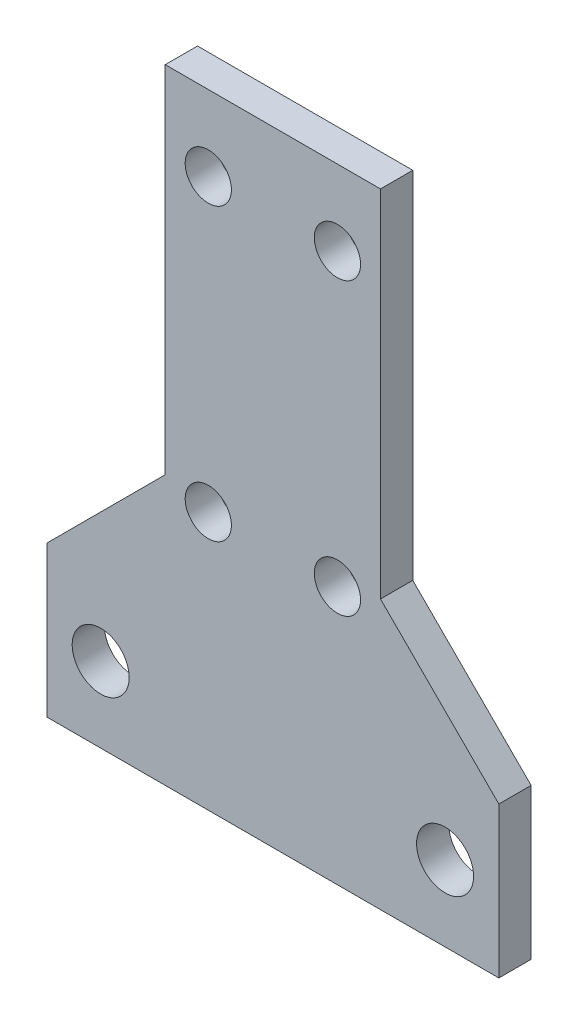
ISO-10303-21;
HEADER;
FILE_DESCRIPTION(('STEP AP214'),'2;1');
FILE_NAME('part.step','',(''),(''),'','','');
FILE_SCHEMA(('AUTOMOTIVE_DESIGN { 1 0 10303 214 1 1 1 1 }'));
ENDSEC;
DATA;
#1=APPLICATION_CONTEXT('core data for automotive mechanical design processes');
#2=APPLICATION_PROTOCOL_DEFINITION('international standard','automotive_design',2000,#1);
#3=PRODUCT_CONTEXT('',#1,'mechanical');
#4=PRODUCT('Part','Part','',(#3));
#5=PRODUCT_RELATED_PRODUCT_CATEGORY('part','',(#4));
#6=PRODUCT_DEFINITION_FORMATION('','',#4);
#7=PRODUCT_DEFINITION_CONTEXT('part definition',#1,'design');
#8=PRODUCT_DEFINITION('design','',#6,#7);
#9=PRODUCT_DEFINITION_SHAPE('','',#8);
#10=(LENGTH_UNIT() NAMED_UNIT(*) SI_UNIT(.MILLI.,.METRE.));
#11=(NAMED_UNIT(*) PLANE_ANGLE_UNIT() SI_UNIT($,.RADIAN.));
#12=(NAMED_UNIT(*) SI_UNIT($,.STERADIAN.) SOLID_ANGLE_UNIT());
#13=UNCERTAINTY_MEASURE_WITH_UNIT(LENGTH_MEASURE(1.E-05),#10,'distance_accuracy_value','');
#14=(GEOMETRIC_REPRESENTATION_CONTEXT(3) GLOBAL_UNCERTAINTY_ASSIGNED_CONTEXT((#13)) GLOBAL_UNIT_ASSIGNED_CONTEXT((#10,
#11,#12)) REPRESENTATION_CONTEXT('',''));
#15=CARTESIAN_POINT('',(0.,0.,0.));
#16=DIRECTION('',(0.,0.,1.));
#17=DIRECTION('',(1.,0.,0.));
#18=AXIS2_PLACEMENT_3D('',#15,#16,#17);
#19=CARTESIAN_POINT('',(0.,0.,3.));
#20=DIRECTION('',(0.,0.,-1.));
#21=DIRECTION('',(-1.,0.,0.));
#22=AXIS2_PLACEMENT_3D('',#19,#20,#21);
#23=PLANE('',#22);
#24=DIRECTION('',(0.,-1.,0.));
#25=VECTOR('',#24,1.);
#26=CARTESIAN_POINT('',(-434.489921235063,165.000000000073,3.));
#27=LINE('',#26,#25);
#28=CARTESIAN_POINT('',(-434.489921235063,179.000000000073,3.));
#29=VERTEX_POINT('',#28);
#30=CARTESIAN_POINT('',(-434.489921235063,165.000000000073,3.));
#31=VERTEX_POINT('',#30);
#32=EDGE_CURVE('E147',#29,#31,#27,.T.);
#33=ORIENTED_EDGE('',*,*,#32,.T.);
#34=DIRECTION('',(1.,0.,0.));
#35=VECTOR('',#34,1.);
#36=CARTESIAN_POINT('',(-434.489921235063,165.000000000073,3.));
#37=LINE('',#36,#35);
#38=CARTESIAN_POINT('',(-392.489921235063,165.000000000073,3.));
#39=VERTEX_POINT('',#38);
#40=EDGE_CURVE('E95',#31,#39,#37,.T.);
#41=ORIENTED_EDGE('',*,*,#40,.T.);
#42=DIRECTION('',(0.,1.,0.));
#43=VECTOR('',#42,1.);
#44=CARTESIAN_POINT('',(-392.489921235063,165.000000000073,3.));
#45=LINE('',#44,#43);
#46=CARTESIAN_POINT('',(-392.489921235063,179.000000000073,3.));
#47=VERTEX_POINT('',#46);
#48=EDGE_CURVE('E162',#39,#47,#45,.T.);
#49=ORIENTED_EDGE('',*,*,#48,.T.);
#50=DIRECTION('',(-0.707106781186552,0.707106781186543,0.));
#51=VECTOR('',#50,1.);
#52=CARTESIAN_POINT('',(-392.489921235063,179.000000000073,3.));
#53=LINE('',#52,#51);
#54=CARTESIAN_POINT('',(-403.489921235063,190.000000000073,3.));
#55=VERTEX_POINT('',#54);
#56=EDGE_CURVE('E175',#47,#55,#53,.T.);
#57=ORIENTED_EDGE('',*,*,#56,.T.);
#58=DIRECTION('',(0.,1.,0.));
#59=VECTOR('',#58,1.);
#60=CARTESIAN_POINT('',(-403.489921235063,190.000000000073,3.));
#61=LINE('',#60,#59);
#62=CARTESIAN_POINT('',(-403.489921235063,223.000000000073,3.));
#63=VERTEX_POINT('',#62);
#64=EDGE_CURVE('E114',#55,#63,#61,.T.);
#65=ORIENTED_EDGE('',*,*,#64,.T.);
#66=DIRECTION('',(-1.,0.,0.));
#67=VECTOR('',#66,1.);
#68=CARTESIAN_POINT('',(-423.489921235064,223.000000000073,3.));
#69=LINE('',#68,#67);
#70=CARTESIAN_POINT('',(-423.489921235064,223.000000000073,3.));
#71=VERTEX_POINT('',#70);
#72=EDGE_CURVE('E108',#63,#71,#69,.T.);
#73=ORIENTED_EDGE('',*,*,#72,.T.);
#74=DIRECTION('',(0.,-1.,0.));
#75=VECTOR('',#74,1.);
#76=CARTESIAN_POINT('',(-423.489921235064,190.000000000073,3.));
#77=LINE('',#76,#75);
#78=CARTESIAN_POINT('',(-423.489921235064,190.000000000073,3.));
#79=VERTEX_POINT('',#78);
#80=EDGE_CURVE('E112',#71,#79,#77,.T.);
#81=ORIENTED_EDGE('',*,*,#80,.T.);
#82=DIRECTION('',(-0.707106781186552,-0.707106781186543,0.));
#83=VECTOR('',#82,1.);
#84=CARTESIAN_POINT('',(-434.489921235063,179.000000000073,3.));
#85=LINE('',#84,#83);
#86=EDGE_CURVE('E52',#79,#29,#85,.T.);
#87=ORIENTED_EDGE('',*,*,#86,.T.);
#88=EDGE_LOOP('',(#33,#41,#49,#57,#65,#73,#81,#87));
#89=FACE_BOUND('',#88,.T.);
#90=CARTESIAN_POINT('',(-397.489921235063,172.000000000073,3.));
#91=DIRECTION('',(0.,0.,1.));
#92=DIRECTION('',(1.,0.,0.));
#93=AXIS2_PLACEMENT_3D('',#90,#91,#92);
#94=CIRCLE('',#93,2.64999999999998);
#95=CARTESIAN_POINT('',(-394.839921235063,172.000000000073,3.));
#96=VERTEX_POINT('',#95);
#97=EDGE_CURVE('E136',#96,#96,#94,.T.);
#98=ORIENTED_EDGE('',*,*,#97,.F.);
#99=EDGE_LOOP('',(#98));
#100=FACE_BOUND('',#99,.T.);
#101=CARTESIAN_POINT('',(-407.489921235063,216.000000000073,3.));
#102=DIRECTION('',(0.,0.,1.));
#103=DIRECTION('',(1.,0.,0.));
#104=AXIS2_PLACEMENT_3D('',#101,#102,#103);
#105=CIRCLE('',#104,2.14999999999996);
#106=CARTESIAN_POINT('',(-405.339921235063,216.000000000073,3.));
#107=VERTEX_POINT('',#106);
#108=EDGE_CURVE('E184',#107,#107,#105,.T.);
#109=ORIENTED_EDGE('',*,*,#108,.F.);
#110=EDGE_LOOP('',(#109));
#111=FACE_BOUND('',#110,.T.);
#112=CARTESIAN_POINT('',(-407.489921235063,189.000000000073,3.));
#113=DIRECTION('',(0.,0.,1.));
#114=DIRECTION('',(1.,0.,0.));
#115=AXIS2_PLACEMENT_3D('',#112,#113,#114);
#116=CIRCLE('',#115,2.14999999999996);
#117=CARTESIAN_POINT('',(-405.339921235063,189.000000000073,3.));
#118=VERTEX_POINT('',#117);
#119=EDGE_CURVE('E190',#118,#118,#116,.T.);
#120=ORIENTED_EDGE('',*,*,#119,.F.);
#121=EDGE_LOOP('',(#120));
#122=FACE_BOUND('',#121,.T.);
#123=CARTESIAN_POINT('',(-429.489921235063,172.000000000073,3.));
#124=DIRECTION('',(0.,0.,1.));
#125=DIRECTION('',(-1.,0.,0.));
#126=AXIS2_PLACEMENT_3D('',#123,#124,#125);
#127=CIRCLE('',#126,2.64999999999998);
#128=CARTESIAN_POINT('',(-432.139921235063,172.000000000073,3.));
#129=VERTEX_POINT('',#128);
#130=EDGE_CURVE('E196',#129,#129,#127,.T.);
#131=ORIENTED_EDGE('',*,*,#130,.F.);
#132=EDGE_LOOP('',(#131));
#133=FACE_BOUND('',#132,.T.);
#134=CARTESIAN_POINT('',(-419.489921235064,189.000000000073,3.));
#135=DIRECTION('',(0.,0.,1.));
#136=DIRECTION('',(-1.,0.,0.));
#137=AXIS2_PLACEMENT_3D('',#134,#135,#136);
#138=CIRCLE('',#137,2.14999999999996);
#139=CARTESIAN_POINT('',(-421.639921235064,189.000000000073,3.));
#140=VERTEX_POINT('',#139);
#141=EDGE_CURVE('E202',#140,#140,#138,.T.);
#142=ORIENTED_EDGE('',*,*,#141,.F.);
#143=EDGE_LOOP('',(#142));
#144=FACE_BOUND('',#143,.T.);
#145=CARTESIAN_POINT('',(-419.489921235064,216.000000000073,3.));
#146=DIRECTION('',(0.,0.,1.));
#147=DIRECTION('',(-1.,0.,0.));
#148=AXIS2_PLACEMENT_3D('',#145,#146,#147);
#149=CIRCLE('',#148,2.14999999999996);
#150=CARTESIAN_POINT('',(-421.639921235064,216.000000000073,3.));
#151=VERTEX_POINT('',#150);
#152=EDGE_CURVE('E208',#151,#151,#149,.T.);
#153=ORIENTED_EDGE('',*,*,#152,.F.);
#154=EDGE_LOOP('',(#153));
#155=FACE_BOUND('',#154,.T.);
#156=ADVANCED_FACE('F35',(#89,#100,#111,#122,#133,#144,#155),#23,.F.);
#157=CARTESIAN_POINT('',(0.,0.,0.));
#158=DIRECTION('',(0.,0.,-1.));
#159=DIRECTION('',(-1.,0.,0.));
#160=AXIS2_PLACEMENT_3D('',#157,#158,#159);
#161=PLANE('',#160);
#162=CARTESIAN_POINT('',(-419.489921235064,189.000000000073,0.));
#163=DIRECTION('',(0.,0.,1.));
#164=DIRECTION('',(-1.,0.,0.));
#165=AXIS2_PLACEMENT_3D('',#162,#163,#164);
#166=CIRCLE('',#165,2.14999999999996);
#167=CARTESIAN_POINT('',(-421.639921235064,189.000000000073,0.));
#168=VERTEX_POINT('',#167);
#169=EDGE_CURVE('E205',#168,#168,#166,.T.);
#170=ORIENTED_EDGE('',*,*,#169,.T.);
#171=EDGE_LOOP('',(#170));
#172=FACE_BOUND('',#171,.T.);
#173=CARTESIAN_POINT('',(-407.489921235063,189.000000000073,0.));
#174=DIRECTION('',(0.,0.,1.));
#175=DIRECTION('',(1.,0.,0.));
#176=AXIS2_PLACEMENT_3D('',#173,#174,#175);
#177=CIRCLE('',#176,2.14999999999996);
#178=CARTESIAN_POINT('',(-405.339921235063,189.000000000073,0.));
#179=VERTEX_POINT('',#178);
#180=EDGE_CURVE('E193',#179,#179,#177,.T.);
#181=ORIENTED_EDGE('',*,*,#180,.T.);
#182=EDGE_LOOP('',(#181));
#183=FACE_BOUND('',#182,.T.);
#184=CARTESIAN_POINT('',(-397.489921235063,172.000000000073,0.));
#185=DIRECTION('',(0.,0.,1.));
#186=DIRECTION('',(1.,0.,0.));
#187=AXIS2_PLACEMENT_3D('',#184,#185,#186);
#188=CIRCLE('',#187,2.64999999999998);
#189=CARTESIAN_POINT('',(-394.839921235063,172.000000000073,0.));
#190=VERTEX_POINT('',#189);
#191=EDGE_CURVE('E181',#190,#190,#188,.T.);
#192=ORIENTED_EDGE('',*,*,#191,.T.);
#193=EDGE_LOOP('',(#192));
#194=FACE_BOUND('',#193,.T.);
#195=DIRECTION('',(0.,-1.,0.));
#196=VECTOR('',#195,1.);
#197=CARTESIAN_POINT('',(-434.489921235063,165.000000000073,0.));
#198=LINE('',#197,#196);
#199=CARTESIAN_POINT('',(-434.489921235063,179.000000000073,0.));
#200=VERTEX_POINT('',#199);
#201=CARTESIAN_POINT('',(-434.489921235063,165.000000000073,0.));
#202=VERTEX_POINT('',#201);
#203=EDGE_CURVE('E132',#200,#202,#198,.T.);
#204=ORIENTED_EDGE('',*,*,#203,.F.);
#205=DIRECTION('',(-0.707106781186552,-0.707106781186543,0.));
#206=VECTOR('',#205,1.);
#207=CARTESIAN_POINT('',(-434.489921235063,179.000000000073,0.));
#208=LINE('',#207,#206);
#209=CARTESIAN_POINT('',(-423.489921235064,190.000000000073,0.));
#210=VERTEX_POINT('',#209);
#211=EDGE_CURVE('E87',#210,#200,#208,.T.);
#212=ORIENTED_EDGE('',*,*,#211,.F.);
#213=DIRECTION('',(0.,-1.,0.));
#214=VECTOR('',#213,1.);
#215=CARTESIAN_POINT('',(-423.489921235064,190.000000000073,0.));
#216=LINE('',#215,#214);
#217=CARTESIAN_POINT('',(-423.489921235064,223.000000000073,0.));
#218=VERTEX_POINT('',#217);
#219=EDGE_CURVE('E81',#218,#210,#216,.T.);
#220=ORIENTED_EDGE('',*,*,#219,.F.);
#221=DIRECTION('',(-1.,0.,0.));
#222=VECTOR('',#221,1.);
#223=CARTESIAN_POINT('',(-423.489921235064,223.000000000073,0.));
#224=LINE('',#223,#222);
#225=CARTESIAN_POINT('',(-403.489921235063,223.000000000073,0.));
#226=VERTEX_POINT('',#225);
#227=EDGE_CURVE('E122',#226,#218,#224,.T.);
#228=ORIENTED_EDGE('',*,*,#227,.F.);
#229=DIRECTION('',(0.,1.,0.));
#230=VECTOR('',#229,1.);
#231=CARTESIAN_POINT('',(-403.489921235063,190.000000000073,0.));
#232=LINE('',#231,#230);
#233=CARTESIAN_POINT('',(-403.489921235063,190.000000000073,0.));
#234=VERTEX_POINT('',#233);
#235=EDGE_CURVE('E142',#234,#226,#232,.T.);
#236=ORIENTED_EDGE('',*,*,#235,.F.);
#237=DIRECTION('',(-0.707106781186552,0.707106781186543,0.));
#238=VECTOR('',#237,1.);
#239=CARTESIAN_POINT('',(-392.489921235063,179.000000000073,0.));
#240=LINE('',#239,#238);
#241=CARTESIAN_POINT('',(-392.489921235063,179.000000000073,0.));
#242=VERTEX_POINT('',#241);
#243=EDGE_CURVE('E140',#242,#234,#240,.T.);
#244=ORIENTED_EDGE('',*,*,#243,.F.);
#245=DIRECTION('',(0.,1.,0.));
#246=VECTOR('',#245,1.);
#247=CARTESIAN_POINT('',(-392.489921235063,165.000000000073,0.));
#248=LINE('',#247,#246);
#249=CARTESIAN_POINT('',(-392.489921235063,165.000000000073,0.));
#250=VERTEX_POINT('',#249);
#251=EDGE_CURVE('E138',#250,#242,#248,.T.);
#252=ORIENTED_EDGE('',*,*,#251,.F.);
#253=DIRECTION('',(1.,0.,0.));
#254=VECTOR('',#253,1.);
#255=CARTESIAN_POINT('',(-434.489921235063,165.000000000073,0.));
#256=LINE('',#255,#254);
#257=EDGE_CURVE('E135',#202,#250,#256,.T.);
#258=ORIENTED_EDGE('',*,*,#257,.F.);
#259=EDGE_LOOP('',(#204,#212,#220,#228,#236,#244,#252,#258));
#260=FACE_BOUND('',#259,.T.);
#261=CARTESIAN_POINT('',(-407.489921235063,216.000000000073,0.));
#262=DIRECTION('',(0.,0.,1.));
#263=DIRECTION('',(1.,0.,0.));
#264=AXIS2_PLACEMENT_3D('',#261,#262,#263);
#265=CIRCLE('',#264,2.14999999999996);
#266=CARTESIAN_POINT('',(-405.339921235063,216.000000000073,0.));
#267=VERTEX_POINT('',#266);
#268=EDGE_CURVE('E187',#267,#267,#265,.T.);
#269=ORIENTED_EDGE('',*,*,#268,.T.);
#270=EDGE_LOOP('',(#269));
#271=FACE_BOUND('',#270,.T.);
#272=CARTESIAN_POINT('',(-429.489921235063,172.000000000073,0.));
#273=DIRECTION('',(0.,0.,1.));
#274=DIRECTION('',(-1.,0.,0.));
#275=AXIS2_PLACEMENT_3D('',#272,#273,#274);
#276=CIRCLE('',#275,2.64999999999998);
#277=CARTESIAN_POINT('',(-432.139921235063,172.000000000073,0.));
#278=VERTEX_POINT('',#277);
#279=EDGE_CURVE('E199',#278,#278,#276,.T.);
#280=ORIENTED_EDGE('',*,*,#279,.T.);
#281=EDGE_LOOP('',(#280));
#282=FACE_BOUND('',#281,.T.);
#283=CARTESIAN_POINT('',(-419.489921235064,216.000000000073,0.));
#284=DIRECTION('',(0.,0.,1.));
#285=DIRECTION('',(-1.,0.,0.));
#286=AXIS2_PLACEMENT_3D('',#283,#284,#285);
#287=CIRCLE('',#286,2.14999999999996);
#288=CARTESIAN_POINT('',(-421.639921235064,216.000000000073,0.));
#289=VERTEX_POINT('',#288);
#290=EDGE_CURVE('E211',#289,#289,#287,.T.);
#291=ORIENTED_EDGE('',*,*,#290,.T.);
#292=EDGE_LOOP('',(#291));
#293=FACE_BOUND('',#292,.T.);
#294=ADVANCED_FACE('F166',(#172,#183,#194,#260,#271,#282,#293),#161,.T.);
#295=CARTESIAN_POINT('',(-434.489921235063,165.000000000073,3.));
#296=DIRECTION('',(1.,0.,0.));
#297=DIRECTION('',(0.,1.,0.));
#298=AXIS2_PLACEMENT_3D('',#295,#296,#297);
#299=PLANE('',#298);
#300=ORIENTED_EDGE('',*,*,#203,.T.);
#301=DIRECTION('',(0.,0.,-1.));
#302=VECTOR('',#301,1.);
#303=CARTESIAN_POINT('',(-434.489921235063,165.000000000073,3.));
#304=LINE('',#303,#302);
#305=EDGE_CURVE('E11',#31,#202,#304,.T.);
#306=ORIENTED_EDGE('',*,*,#305,.F.);
#307=ORIENTED_EDGE('',*,*,#32,.F.);
#308=DIRECTION('',(0.,0.,-1.));
#309=VECTOR('',#308,1.);
#310=CARTESIAN_POINT('',(-434.489921235063,179.000000000073,3.));
#311=LINE('',#310,#309);
#312=EDGE_CURVE('E128',#29,#200,#311,.T.);
#313=ORIENTED_EDGE('',*,*,#312,.T.);
#314=EDGE_LOOP('',(#300,#306,#307,#313));
#315=FACE_BOUND('',#314,.T.);
#316=ADVANCED_FACE('F37',(#315),#299,.F.);
#317=CARTESIAN_POINT('',(-434.489921235063,165.000000000073,3.));
#318=DIRECTION('',(0.,1.,0.));
#319=DIRECTION('',(0.,0.,1.));
#320=AXIS2_PLACEMENT_3D('',#317,#318,#319);
#321=PLANE('',#320);
#322=ORIENTED_EDGE('',*,*,#257,.T.);
#323=DIRECTION('',(0.,0.,-1.));
#324=VECTOR('',#323,1.);
#325=CARTESIAN_POINT('',(-392.489921235063,165.000000000073,3.));
#326=LINE('',#325,#324);
#327=EDGE_CURVE('E44',#39,#250,#326,.T.);
#328=ORIENTED_EDGE('',*,*,#327,.F.);
#329=ORIENTED_EDGE('',*,*,#40,.F.);
#330=ORIENTED_EDGE('',*,*,#305,.T.);
#331=EDGE_LOOP('',(#322,#328,#329,#330));
#332=FACE_BOUND('',#331,.T.);
#333=ADVANCED_FACE('F243',(#332),#321,.F.);
#334=CARTESIAN_POINT('',(-392.489921235063,165.000000000073,3.));
#335=DIRECTION('',(-1.,0.,0.));
#336=DIRECTION('',(0.,0.,1.));
#337=AXIS2_PLACEMENT_3D('',#334,#335,#336);
#338=PLANE('',#337);
#339=ORIENTED_EDGE('',*,*,#251,.T.);
#340=DIRECTION('',(0.,0.,-1.));
#341=VECTOR('',#340,1.);
#342=CARTESIAN_POINT('',(-392.489921235063,179.000000000073,3.));
#343=LINE('',#342,#341);
#344=EDGE_CURVE('E154',#47,#242,#343,.T.);
#345=ORIENTED_EDGE('',*,*,#344,.F.);
#346=ORIENTED_EDGE('',*,*,#48,.F.);
#347=ORIENTED_EDGE('',*,*,#327,.T.);
#348=EDGE_LOOP('',(#339,#345,#346,#347));
#349=FACE_BOUND('',#348,.T.);
#350=ADVANCED_FACE('F160',(#349),#338,.F.);
#351=CARTESIAN_POINT('',(-392.489921235063,179.000000000073,3.));
#352=DIRECTION('',(-0.707106781186543,-0.707106781186552,0.));
#353=DIRECTION('',(0.707106781186552,-0.707106781186543,0.));
#354=AXIS2_PLACEMENT_3D('',#351,#352,#353);
#355=PLANE('',#354);
#356=ORIENTED_EDGE('',*,*,#243,.T.);
#357=DIRECTION('',(0.,0.,-1.));
#358=VECTOR('',#357,1.);
#359=CARTESIAN_POINT('',(-403.489921235063,190.000000000073,3.));
#360=LINE('',#359,#358);
#361=EDGE_CURVE('E151',#55,#234,#360,.T.);
#362=ORIENTED_EDGE('',*,*,#361,.F.);
#363=ORIENTED_EDGE('',*,*,#56,.F.);
#364=ORIENTED_EDGE('',*,*,#344,.T.);
#365=EDGE_LOOP('',(#356,#362,#363,#364));
#366=FACE_BOUND('',#365,.T.);
#367=ADVANCED_FACE('F171',(#366),#355,.F.);
#368=CARTESIAN_POINT('',(-403.489921235063,190.000000000073,3.));
#369=DIRECTION('',(-1.,0.,0.));
#370=DIRECTION('',(0.,0.,1.));
#371=AXIS2_PLACEMENT_3D('',#368,#369,#370);
#372=PLANE('',#371);
#373=ORIENTED_EDGE('',*,*,#235,.T.);
#374=DIRECTION('',(0.,0.,-1.));
#375=VECTOR('',#374,1.);
#376=CARTESIAN_POINT('',(-403.489921235063,223.000000000073,3.));
#377=LINE('',#376,#375);
#378=EDGE_CURVE('E123',#63,#226,#377,.T.);
#379=ORIENTED_EDGE('',*,*,#378,.F.);
#380=ORIENTED_EDGE('',*,*,#64,.F.);
#381=ORIENTED_EDGE('',*,*,#361,.T.);
#382=EDGE_LOOP('',(#373,#379,#380,#381));
#383=FACE_BOUND('',#382,.T.);
#384=ADVANCED_FACE('F174',(#383),#372,.F.);
#385=CARTESIAN_POINT('',(-423.489921235064,223.000000000073,3.));
#386=DIRECTION('',(0.,-1.,0.));
#387=DIRECTION('',(0.,0.,-1.));
#388=AXIS2_PLACEMENT_3D('',#385,#386,#387);
#389=PLANE('',#388);
#390=ORIENTED_EDGE('',*,*,#227,.T.);
#391=DIRECTION('',(0.,0.,-1.));
#392=VECTOR('',#391,1.);
#393=CARTESIAN_POINT('',(-423.489921235064,223.000000000073,3.));
#394=LINE('',#393,#392);
#395=EDGE_CURVE('E119',#71,#218,#394,.T.);
#396=ORIENTED_EDGE('',*,*,#395,.F.);
#397=ORIENTED_EDGE('',*,*,#72,.F.);
#398=ORIENTED_EDGE('',*,*,#378,.T.);
#399=EDGE_LOOP('',(#390,#396,#397,#398));
#400=FACE_BOUND('',#399,.T.);
#401=ADVANCED_FACE('F120',(#400),#389,.F.);
#402=CARTESIAN_POINT('',(-423.489921235064,190.000000000073,3.));
#403=DIRECTION('',(1.,0.,0.));
#404=DIRECTION('',(0.,0.,-1.));
#405=AXIS2_PLACEMENT_3D('',#402,#403,#404);
#406=PLANE('',#405);
#407=ORIENTED_EDGE('',*,*,#219,.T.);
#408=DIRECTION('',(0.,0.,-1.));
#409=VECTOR('',#408,1.);
#410=CARTESIAN_POINT('',(-423.489921235064,190.000000000073,3.));
#411=LINE('',#410,#409);
#412=EDGE_CURVE('E124',#79,#210,#411,.T.);
#413=ORIENTED_EDGE('',*,*,#412,.F.);
#414=ORIENTED_EDGE('',*,*,#80,.F.);
#415=ORIENTED_EDGE('',*,*,#395,.T.);
#416=EDGE_LOOP('',(#407,#413,#414,#415));
#417=FACE_BOUND('',#416,.T.);
#418=ADVANCED_FACE('F126',(#417),#406,.F.);
#419=CARTESIAN_POINT('',(-434.489921235063,179.000000000073,3.));
#420=DIRECTION('',(0.707106781186543,-0.707106781186552,0.));
#421=DIRECTION('',(0.707106781186552,0.707106781186543,0.));
#422=AXIS2_PLACEMENT_3D('',#419,#420,#421);
#423=PLANE('',#422);
#424=ORIENTED_EDGE('',*,*,#211,.T.);
#425=ORIENTED_EDGE('',*,*,#312,.F.);
#426=ORIENTED_EDGE('',*,*,#86,.F.);
#427=ORIENTED_EDGE('',*,*,#412,.T.);
#428=EDGE_LOOP('',(#424,#425,#426,#427));
#429=FACE_BOUND('',#428,.T.);
#430=ADVANCED_FACE('F231',(#429),#423,.F.);
#431=CARTESIAN_POINT('',(-397.489921235063,172.000000000073,3.));
#432=DIRECTION('',(0.,0.,-1.));
#433=DIRECTION('',(-1.,0.,0.));
#434=AXIS2_PLACEMENT_3D('',#431,#432,#433);
#435=CYLINDRICAL_SURFACE('',#434,2.64999999999998);
#436=ORIENTED_EDGE('',*,*,#97,.T.);
#437=EDGE_LOOP('',(#436));
#438=FACE_BOUND('',#437,.T.);
#439=ORIENTED_EDGE('',*,*,#191,.F.);
#440=EDGE_LOOP('',(#439));
#441=FACE_BOUND('',#440,.T.);
#442=ADVANCED_FACE('F228',(#438,#441),#435,.F.);
#443=CARTESIAN_POINT('',(-407.489921235063,216.000000000073,3.));
#444=DIRECTION('',(0.,0.,-1.));
#445=DIRECTION('',(-1.,0.,0.));
#446=AXIS2_PLACEMENT_3D('',#443,#444,#445);
#447=CYLINDRICAL_SURFACE('',#446,2.14999999999996);
#448=ORIENTED_EDGE('',*,*,#108,.T.);
#449=EDGE_LOOP('',(#448));
#450=FACE_BOUND('',#449,.T.);
#451=ORIENTED_EDGE('',*,*,#268,.F.);
#452=EDGE_LOOP('',(#451));
#453=FACE_BOUND('',#452,.T.);
#454=ADVANCED_FACE('F307',(#450,#453),#447,.F.);
#455=CARTESIAN_POINT('',(-407.489921235063,189.000000000073,3.));
#456=DIRECTION('',(0.,0.,-1.));
#457=DIRECTION('',(-1.,0.,0.));
#458=AXIS2_PLACEMENT_3D('',#455,#456,#457);
#459=CYLINDRICAL_SURFACE('',#458,2.14999999999996);
#460=ORIENTED_EDGE('',*,*,#119,.T.);
#461=EDGE_LOOP('',(#460));
#462=FACE_BOUND('',#461,.T.);
#463=ORIENTED_EDGE('',*,*,#180,.F.);
#464=EDGE_LOOP('',(#463));
#465=FACE_BOUND('',#464,.T.);
#466=ADVANCED_FACE('F315',(#462,#465),#459,.F.);
#467=CARTESIAN_POINT('',(-429.489921235063,172.000000000073,3.));
#468=DIRECTION('',(0.,0.,-1.));
#469=DIRECTION('',(-1.,0.,0.));
#470=AXIS2_PLACEMENT_3D('',#467,#468,#469);
#471=CYLINDRICAL_SURFACE('',#470,2.64999999999998);
#472=ORIENTED_EDGE('',*,*,#130,.T.);
#473=EDGE_LOOP('',(#472));
#474=FACE_BOUND('',#473,.T.);
#475=ORIENTED_EDGE('',*,*,#279,.F.);
#476=EDGE_LOOP('',(#475));
#477=FACE_BOUND('',#476,.T.);
#478=ADVANCED_FACE('F323',(#474,#477),#471,.F.);
#479=CARTESIAN_POINT('',(-419.489921235064,189.000000000073,3.));
#480=DIRECTION('',(0.,0.,-1.));
#481=DIRECTION('',(-1.,0.,0.));
#482=AXIS2_PLACEMENT_3D('',#479,#480,#481);
#483=CYLINDRICAL_SURFACE('',#482,2.14999999999996);
#484=ORIENTED_EDGE('',*,*,#141,.T.);
#485=EDGE_LOOP('',(#484));
#486=FACE_BOUND('',#485,.T.);
#487=ORIENTED_EDGE('',*,*,#169,.F.);
#488=EDGE_LOOP('',(#487));
#489=FACE_BOUND('',#488,.T.);
#490=ADVANCED_FACE('F332',(#486,#489),#483,.F.);
#491=CARTESIAN_POINT('',(-419.489921235064,216.000000000073,3.));
#492=DIRECTION('',(0.,0.,-1.));
#493=DIRECTION('',(-1.,0.,0.));
#494=AXIS2_PLACEMENT_3D('',#491,#492,#493);
#495=CYLINDRICAL_SURFACE('',#494,2.14999999999996);
#496=ORIENTED_EDGE('',*,*,#152,.T.);
#497=EDGE_LOOP('',(#496));
#498=FACE_BOUND('',#497,.T.);
#499=ORIENTED_EDGE('',*,*,#290,.F.);
#500=EDGE_LOOP('',(#499));
#501=FACE_BOUND('',#500,.T.);
#502=ADVANCED_FACE('F217',(#498,#501),#495,.F.);
#503=CLOSED_SHELL('',(#156,#294,#316,#333,#350,#367,#384,#401,#418,#430,#442,#454,#466,#478,
#490,#502));
#504=MANIFOLD_SOLID_BREP('B2',#503);
#505=ADVANCED_BREP_SHAPE_REPRESENTATION('',(#18,#504),#14);
#506=SHAPE_DEFINITION_REPRESENTATION(#9,#505);
ENDSEC;
END-ISO-10303-21;
